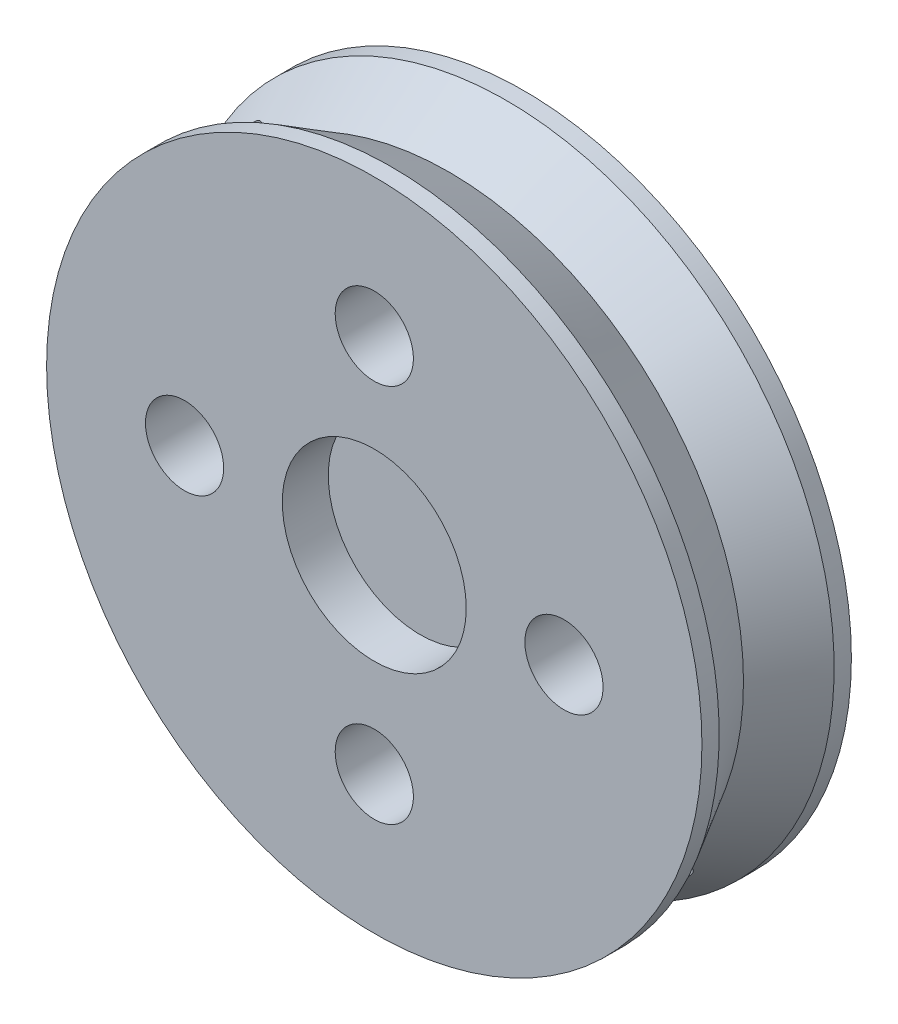
ISO-10303-21;
HEADER;
FILE_DESCRIPTION(('STEP AP214'),'2;1');
FILE_NAME('part.step','',(''),(''),'','','');
FILE_SCHEMA(('AUTOMOTIVE_DESIGN { 1 0 10303 214 1 1 1 1 }'));
ENDSEC;
DATA;
#1=APPLICATION_CONTEXT('core data for automotive mechanical design processes');
#2=APPLICATION_PROTOCOL_DEFINITION('international standard','automotive_design',2000,#1);
#3=PRODUCT_CONTEXT('',#1,'mechanical');
#4=PRODUCT('Part','Part','',(#3));
#5=PRODUCT_RELATED_PRODUCT_CATEGORY('part','',(#4));
#6=PRODUCT_DEFINITION_FORMATION('','',#4);
#7=PRODUCT_DEFINITION_CONTEXT('part definition',#1,'design');
#8=PRODUCT_DEFINITION('design','',#6,#7);
#9=PRODUCT_DEFINITION_SHAPE('','',#8);
#10=(LENGTH_UNIT() NAMED_UNIT(*) SI_UNIT(.MILLI.,.METRE.));
#11=(NAMED_UNIT(*) PLANE_ANGLE_UNIT() SI_UNIT($,.RADIAN.));
#12=(NAMED_UNIT(*) SI_UNIT($,.STERADIAN.) SOLID_ANGLE_UNIT());
#13=UNCERTAINTY_MEASURE_WITH_UNIT(LENGTH_MEASURE(1.E-05),#10,'distance_accuracy_value','');
#14=(GEOMETRIC_REPRESENTATION_CONTEXT(3) GLOBAL_UNCERTAINTY_ASSIGNED_CONTEXT((#13)) GLOBAL_UNIT_ASSIGNED_CONTEXT((#10,
#11,#12)) REPRESENTATION_CONTEXT('',''));
#15=CARTESIAN_POINT('',(0.,0.,0.));
#16=DIRECTION('',(0.,0.,1.));
#17=DIRECTION('',(1.,0.,0.));
#18=AXIS2_PLACEMENT_3D('',#15,#16,#17);
#19=CARTESIAN_POINT('',(0.,0.,3.25));
#20=DIRECTION('',(0.,0.,-1.));
#21=DIRECTION('',(-1.,0.,0.));
#22=AXIS2_PLACEMENT_3D('',#19,#20,#21);
#23=CYLINDRICAL_SURFACE('',#22,14.25);
#24=CARTESIAN_POINT('',(0.,0.,-3.25));
#25=DIRECTION('',(0.,0.,1.));
#26=DIRECTION('',(1.,0.,0.));
#27=AXIS2_PLACEMENT_3D('',#24,#25,#26);
#28=CIRCLE('',#27,14.25);
#29=CARTESIAN_POINT('',(14.25,0.,-3.25));
#30=VERTEX_POINT('',#29);
#31=EDGE_CURVE('E98',#30,#30,#28,.T.);
#32=ORIENTED_EDGE('',*,*,#31,.T.);
#33=EDGE_LOOP('',(#32));
#34=FACE_BOUND('',#33,.T.);
#35=CARTESIAN_POINT('',(0.,0.,-2.5));
#36=DIRECTION('',(0.,0.,-1.));
#37=DIRECTION('',(-1.,0.,0.));
#38=AXIS2_PLACEMENT_3D('',#35,#36,#37);
#39=CIRCLE('',#38,14.25);
#40=CARTESIAN_POINT('',(-14.25,0.,-2.5));
#41=VERTEX_POINT('',#40);
#42=EDGE_CURVE('E101',#41,#41,#39,.T.);
#43=ORIENTED_EDGE('',*,*,#42,.T.);
#44=EDGE_LOOP('',(#43));
#45=FACE_BOUND('',#44,.T.);
#46=ADVANCED_FACE('F37',(#34,#45),#23,.T.);
#47=CARTESIAN_POINT('',(0.,0.,3.25));
#48=DIRECTION('',(0.,0.,1.));
#49=DIRECTION('',(1.,0.,0.));
#50=AXIS2_PLACEMENT_3D('',#47,#48,#49);
#51=CIRCLE('',#50,14.25);
#52=CARTESIAN_POINT('',(14.25,0.,3.25));
#53=VERTEX_POINT('',#52);
#54=EDGE_CURVE('E125',#53,#53,#51,.T.);
#55=ORIENTED_EDGE('',*,*,#54,.F.);
#56=EDGE_LOOP('',(#55));
#57=FACE_BOUND('',#56,.T.);
#58=CARTESIAN_POINT('',(0.,0.,2.5));
#59=DIRECTION('',(0.,0.,-1.));
#60=DIRECTION('',(-1.,0.,0.));
#61=AXIS2_PLACEMENT_3D('',#58,#59,#60);
#62=CIRCLE('',#61,14.25);
#63=CARTESIAN_POINT('',(-14.25,0.,2.5));
#64=VERTEX_POINT('',#63);
#65=EDGE_CURVE('E75',#64,#64,#62,.T.);
#66=ORIENTED_EDGE('',*,*,#65,.F.);
#67=EDGE_LOOP('',(#66));
#68=FACE_BOUND('',#67,.T.);
#69=ADVANCED_FACE('F88',(#57,#68),#23,.T.);
#70=CARTESIAN_POINT('',(0.,0.,3.25));
#71=DIRECTION('',(0.,0.,1.));
#72=DIRECTION('',(1.,0.,0.));
#73=AXIS2_PLACEMENT_3D('',#70,#71,#72);
#74=PLANE('',#73);
#75=CARTESIAN_POINT('',(0.,0.,3.25));
#76=DIRECTION('',(0.,0.,1.));
#77=DIRECTION('',(1.,0.,0.));
#78=AXIS2_PLACEMENT_3D('',#75,#76,#77);
#79=CIRCLE('',#78,4.);
#80=CARTESIAN_POINT('',(4.,0.,3.25));
#81=VERTEX_POINT('',#80);
#82=EDGE_CURVE('E103',#81,#81,#79,.T.);
#83=ORIENTED_EDGE('',*,*,#82,.F.);
#84=EDGE_LOOP('',(#83));
#85=FACE_BOUND('',#84,.T.);
#86=CARTESIAN_POINT('',(8.25,0.,3.25));
#87=DIRECTION('',(0.,0.,-1.));
#88=DIRECTION('',(-1.,0.,0.));
#89=AXIS2_PLACEMENT_3D('',#86,#87,#88);
#90=CIRCLE('',#89,1.7);
#91=CARTESIAN_POINT('',(6.55,0.,3.25));
#92=VERTEX_POINT('',#91);
#93=EDGE_CURVE('E113',#92,#92,#90,.T.);
#94=ORIENTED_EDGE('',*,*,#93,.T.);
#95=EDGE_LOOP('',(#94));
#96=FACE_BOUND('',#95,.T.);
#97=CARTESIAN_POINT('',(0.,8.25,3.25));
#98=DIRECTION('',(0.,0.,-1.));
#99=DIRECTION('',(-1.,0.,0.));
#100=AXIS2_PLACEMENT_3D('',#97,#98,#99);
#101=CIRCLE('',#100,1.7);
#102=CARTESIAN_POINT('',(-1.7,8.25,3.25));
#103=VERTEX_POINT('',#102);
#104=EDGE_CURVE('E117',#103,#103,#101,.T.);
#105=ORIENTED_EDGE('',*,*,#104,.T.);
#106=EDGE_LOOP('',(#105));
#107=FACE_BOUND('',#106,.T.);
#108=CARTESIAN_POINT('',(-8.25,0.,3.25));
#109=DIRECTION('',(0.,0.,-1.));
#110=DIRECTION('',(-1.,0.,0.));
#111=AXIS2_PLACEMENT_3D('',#108,#109,#110);
#112=CIRCLE('',#111,1.7);
#113=CARTESIAN_POINT('',(-9.95,0.,3.25));
#114=VERTEX_POINT('',#113);
#115=EDGE_CURVE('E120',#114,#114,#112,.T.);
#116=ORIENTED_EDGE('',*,*,#115,.T.);
#117=EDGE_LOOP('',(#116));
#118=FACE_BOUND('',#117,.T.);
#119=CARTESIAN_POINT('',(0.,-8.25,3.25));
#120=DIRECTION('',(0.,0.,-1.));
#121=DIRECTION('',(-1.,0.,0.));
#122=AXIS2_PLACEMENT_3D('',#119,#120,#121);
#123=CIRCLE('',#122,1.7);
#124=CARTESIAN_POINT('',(-1.7,-8.25,3.25));
#125=VERTEX_POINT('',#124);
#126=EDGE_CURVE('E111',#125,#125,#123,.T.);
#127=ORIENTED_EDGE('',*,*,#126,.T.);
#128=EDGE_LOOP('',(#127));
#129=FACE_BOUND('',#128,.T.);
#130=ORIENTED_EDGE('',*,*,#54,.T.);
#131=EDGE_LOOP('',(#130));
#132=FACE_BOUND('',#131,.T.);
#133=ADVANCED_FACE('F93',(#85,#96,#107,#118,#129,#132),#74,.T.);
#134=CARTESIAN_POINT('',(0.,0.,-3.25));
#135=DIRECTION('',(0.,0.,1.));
#136=DIRECTION('',(1.,0.,0.));
#137=AXIS2_PLACEMENT_3D('',#134,#135,#136);
#138=PLANE('',#137);
#139=CARTESIAN_POINT('',(8.25,0.,-3.25));
#140=DIRECTION('',(0.,0.,1.));
#141=DIRECTION('',(1.,0.,0.));
#142=AXIS2_PLACEMENT_3D('',#139,#140,#141);
#143=CIRCLE('',#142,1.7);
#144=CARTESIAN_POINT('',(9.95,0.,-3.25));
#145=VERTEX_POINT('',#144);
#146=EDGE_CURVE('E130',#145,#145,#143,.T.);
#147=ORIENTED_EDGE('',*,*,#146,.T.);
#148=EDGE_LOOP('',(#147));
#149=FACE_BOUND('',#148,.T.);
#150=CARTESIAN_POINT('',(0.,8.25,-3.25));
#151=DIRECTION('',(0.,0.,1.));
#152=DIRECTION('',(1.,0.,0.));
#153=AXIS2_PLACEMENT_3D('',#150,#151,#152);
#154=CIRCLE('',#153,1.7);
#155=CARTESIAN_POINT('',(1.7,8.25,-3.25));
#156=VERTEX_POINT('',#155);
#157=EDGE_CURVE('E136',#156,#156,#154,.T.);
#158=ORIENTED_EDGE('',*,*,#157,.T.);
#159=EDGE_LOOP('',(#158));
#160=FACE_BOUND('',#159,.T.);
#161=CARTESIAN_POINT('',(-8.25,0.,-3.25));
#162=DIRECTION('',(0.,0.,1.));
#163=DIRECTION('',(1.,0.,0.));
#164=AXIS2_PLACEMENT_3D('',#161,#162,#163);
#165=CIRCLE('',#164,1.7);
#166=CARTESIAN_POINT('',(-6.55,0.,-3.25));
#167=VERTEX_POINT('',#166);
#168=EDGE_CURVE('E133',#167,#167,#165,.T.);
#169=ORIENTED_EDGE('',*,*,#168,.T.);
#170=EDGE_LOOP('',(#169));
#171=FACE_BOUND('',#170,.T.);
#172=CARTESIAN_POINT('',(0.,-8.25,-3.25));
#173=DIRECTION('',(0.,0.,1.));
#174=DIRECTION('',(1.,0.,0.));
#175=AXIS2_PLACEMENT_3D('',#172,#173,#174);
#176=CIRCLE('',#175,1.7);
#177=CARTESIAN_POINT('',(1.7,-8.25,-3.25));
#178=VERTEX_POINT('',#177);
#179=EDGE_CURVE('E116',#178,#178,#176,.T.);
#180=ORIENTED_EDGE('',*,*,#179,.T.);
#181=EDGE_LOOP('',(#180));
#182=FACE_BOUND('',#181,.T.);
#183=ORIENTED_EDGE('',*,*,#31,.F.);
#184=EDGE_LOOP('',(#183));
#185=FACE_BOUND('',#184,.T.);
#186=ADVANCED_FACE('F186',(#149,#160,#171,#182,#185),#138,.F.);
#187=CARTESIAN_POINT('',(0.,-8.25,3.25));
#188=DIRECTION('',(0.,0.,-1.));
#189=DIRECTION('',(-1.,0.,0.));
#190=AXIS2_PLACEMENT_3D('',#187,#188,#189);
#191=CYLINDRICAL_SURFACE('',#190,1.7);
#192=ORIENTED_EDGE('',*,*,#126,.F.);
#193=EDGE_LOOP('',(#192));
#194=FACE_BOUND('',#193,.T.);
#195=ORIENTED_EDGE('',*,*,#179,.F.);
#196=EDGE_LOOP('',(#195));
#197=FACE_BOUND('',#196,.T.);
#198=ADVANCED_FACE('F182',(#194,#197),#191,.F.);
#199=CARTESIAN_POINT('',(-8.25,0.,3.25));
#200=DIRECTION('',(0.,0.,-1.));
#201=DIRECTION('',(-1.,0.,0.));
#202=AXIS2_PLACEMENT_3D('',#199,#200,#201);
#203=CYLINDRICAL_SURFACE('',#202,1.7);
#204=ORIENTED_EDGE('',*,*,#115,.F.);
#205=EDGE_LOOP('',(#204));
#206=FACE_BOUND('',#205,.T.);
#207=ORIENTED_EDGE('',*,*,#168,.F.);
#208=EDGE_LOOP('',(#207));
#209=FACE_BOUND('',#208,.T.);
#210=ADVANCED_FACE('F178',(#206,#209),#203,.F.);
#211=CARTESIAN_POINT('',(0.,8.25,3.25));
#212=DIRECTION('',(0.,0.,-1.));
#213=DIRECTION('',(-1.,0.,0.));
#214=AXIS2_PLACEMENT_3D('',#211,#212,#213);
#215=CYLINDRICAL_SURFACE('',#214,1.7);
#216=ORIENTED_EDGE('',*,*,#104,.F.);
#217=EDGE_LOOP('',(#216));
#218=FACE_BOUND('',#217,.T.);
#219=ORIENTED_EDGE('',*,*,#157,.F.);
#220=EDGE_LOOP('',(#219));
#221=FACE_BOUND('',#220,.T.);
#222=ADVANCED_FACE('F174',(#218,#221),#215,.F.);
#223=CARTESIAN_POINT('',(8.25,0.,3.25));
#224=DIRECTION('',(0.,0.,-1.));
#225=DIRECTION('',(-1.,0.,0.));
#226=AXIS2_PLACEMENT_3D('',#223,#224,#225);
#227=CYLINDRICAL_SURFACE('',#226,1.7);
#228=ORIENTED_EDGE('',*,*,#93,.F.);
#229=EDGE_LOOP('',(#228));
#230=FACE_BOUND('',#229,.T.);
#231=ORIENTED_EDGE('',*,*,#146,.F.);
#232=EDGE_LOOP('',(#231));
#233=FACE_BOUND('',#232,.T.);
#234=ADVANCED_FACE('F168',(#230,#233),#227,.F.);
#235=CARTESIAN_POINT('',(0.,0.,1.25));
#236=DIRECTION('',(0.,0.,1.));
#237=DIRECTION('',(1.,0.,0.));
#238=AXIS2_PLACEMENT_3D('',#235,#236,#237);
#239=CYLINDRICAL_SURFACE('',#238,4.);
#240=CARTESIAN_POINT('',(0.,0.,1.25));
#241=DIRECTION('',(0.,0.,1.));
#242=DIRECTION('',(1.,0.,0.));
#243=AXIS2_PLACEMENT_3D('',#240,#241,#242);
#244=CIRCLE('',#243,4.);
#245=CARTESIAN_POINT('',(4.,0.,1.25));
#246=VERTEX_POINT('',#245);
#247=EDGE_CURVE('E106',#246,#246,#244,.T.);
#248=ORIENTED_EDGE('',*,*,#247,.F.);
#249=EDGE_LOOP('',(#248));
#250=FACE_BOUND('',#249,.T.);
#251=ORIENTED_EDGE('',*,*,#82,.T.);
#252=EDGE_LOOP('',(#251));
#253=FACE_BOUND('',#252,.T.);
#254=ADVANCED_FACE('F163',(#250,#253),#239,.F.);
#255=CARTESIAN_POINT('',(0.,0.,1.25));
#256=DIRECTION('',(0.,0.,1.));
#257=DIRECTION('',(1.,0.,0.));
#258=AXIS2_PLACEMENT_3D('',#255,#256,#257);
#259=PLANE('',#258);
#260=ORIENTED_EDGE('',*,*,#247,.T.);
#261=EDGE_LOOP('',(#260));
#262=FACE_BOUND('',#261,.T.);
#263=ADVANCED_FACE('F158',(#262),#259,.T.);
#264=CARTESIAN_POINT('',(0.,0.,-2.5));
#265=DIRECTION('',(0.,0.,-1.));
#266=DIRECTION('',(-1.,0.,0.));
#267=AXIS2_PLACEMENT_3D('',#264,#265,#266);
#268=CONICAL_SURFACE('',#267,14.25,0.523598775598292);
#269=ORIENTED_EDGE('',*,*,#42,.F.);
#270=EDGE_LOOP('',(#269));
#271=FACE_BOUND('',#270,.T.);
#272=CARTESIAN_POINT('',(-9.69079671991878,8.28370044744857,0.100200000000004));
#273=CARTESIAN_POINT('',(-9.72581511140447,8.30822090664354,0.02644529594719));
#274=CARTESIAN_POINT('',(-9.75564038203565,8.33920091940911,-0.047638559430386));
#275=CARTESIAN_POINT('',(-9.80399947065931,8.41274689544868,-0.194090204391514));
#276=CARTESIAN_POINT('',(-9.82249065471706,8.45535574374428,-0.266450542252277));
#277=CARTESIAN_POINT('',(-9.84551115188123,8.54483612838443,-0.397985848404719));
#278=CARTESIAN_POINT('',(-9.85146336262251,8.59056151454557,-0.457694868896665));
#279=CARTESIAN_POINT('',(-9.85288188171264,8.68857192631421,-0.57146688912725));
#280=CARTESIAN_POINT('',(-9.8483747683949,8.74084000677564,-0.625543835619254));
#281=CARTESIAN_POINT('',(-9.83028503925356,8.83829151375396,-0.714686340066969));
#282=CARTESIAN_POINT('',(-9.8189387656986,8.8824725506826,-0.751307545162907));
#283=CARTESIAN_POINT('',(-9.78901032550382,8.97297663183407,-0.818524304728153));
#284=CARTESIAN_POINT('',(-9.77042961585611,9.0192992430963,-0.84912107063304));
#285=CARTESIAN_POINT('',(-9.72570708811944,9.11311036290723,-0.903055959301775));
#286=CARTESIAN_POINT('',(-9.69951080132944,9.16060493156365,-0.926339185649925));
#287=CARTESIAN_POINT('',(-9.63990681364155,9.25463266275416,-0.963884522086547));
#288=CARTESIAN_POINT('',(-9.60650651525424,9.3011667588428,-0.978155833716208));
#289=CARTESIAN_POINT('',(-9.53831535653112,9.38525564439867,-0.995417957348251));
#290=CARTESIAN_POINT('',(-9.50429525631122,9.42318318630279,-0.999652977573657));
#291=CARTESIAN_POINT('',(-9.43260463443161,9.49547535239926,-1.00030542940599));
#292=CARTESIAN_POINT('',(-9.39493568948649,9.52984150234632,-0.996726223370881));
#293=CARTESIAN_POINT('',(-9.32001028963944,9.59166946659561,-0.982507159543687));
#294=CARTESIAN_POINT('',(-9.28291379916564,9.61944798653306,-0.972385671789535));
#295=CARTESIAN_POINT('',(-9.20776588130256,9.67046554631907,-0.946106607271757));
#296=CARTESIAN_POINT('',(-9.16971434444028,9.69370406305943,-0.929948335561806));
#297=CARTESIAN_POINT('',(-9.0917803887064,9.73639156136555,-0.891367415450536));
#298=CARTESIAN_POINT('',(-9.05189954976148,9.75559927940003,-0.868676777899872));
#299=CARTESIAN_POINT('',(-8.9731132798436,9.78869550250934,-0.818300156433108));
#300=CARTESIAN_POINT('',(-8.9342082622442,9.80258178775306,-0.790612094914946));
#301=CARTESIAN_POINT('',(-8.85313268309581,9.82665820584167,-0.727195481671077));
#302=CARTESIAN_POINT('',(-8.81120109605787,9.83612678102689,-0.690888881887666));
#303=CARTESIAN_POINT('',(-8.73034164890999,9.84879177806444,-0.614090069502888));
#304=CARTESIAN_POINT('',(-8.6914155298864,9.85198459013387,-0.573595462069736));
#305=CARTESIAN_POINT('',(-8.61135783942709,9.85251525240292,-0.482773554381558));
#306=CARTESIAN_POINT('',(-8.57083819845563,9.84885606663114,-0.431900298355095));
#307=CARTESIAN_POINT('',(-8.4954037849608,9.83420368476448,-0.327133553056357));
#308=CARTESIAN_POINT('',(-8.46049203351731,9.82320655190511,-0.273238456809138));
#309=CARTESIAN_POINT('',(-8.3984934050378,9.79506500517308,-0.166281175176765));
#310=CARTESIAN_POINT('',(-8.37110896951344,9.77824488412523,-0.113305540037967));
#311=CARTESIAN_POINT('',(-8.32259955844085,9.73878890761034,-0.00676627805356758));
#312=CARTESIAN_POINT('',(-8.30146536905265,9.71616170559783,0.0467963613422926));
#313=CARTESIAN_POINT('',(-8.28370044744841,9.69079671991892,0.100200000000003));
#314=B_SPLINE_CURVE_WITH_KNOTS('',3,(#272,#273,#274,#275,#276,#277,#278,#279,#280,#281,#282,
#283,#284,#285,#286,#287,#288,#289,#290,#291,#292,#293,#294,#295,#296,#297,#298,#299,#300,#301,
#302,#303,#304,#305,#306,#307,#308,#309,#310,#311,#312,#313),.UNSPECIFIED.,.F.,.F.,(4,2,2,2,2,2,
2,2,2,2,2,2,2,2,2,2,2,2,2,2,4),(0.,0.255397539316976,0.511749970827129,0.736969068994397,
0.96161648669053,1.13640328912081,1.3111549082454,1.4871885140142,1.6630420902561,
1.81559289276677,1.96807806762703,2.10975651977983,2.25145128679065,2.40008397319043,
2.5487785942694,2.71693313164951,2.88518436228274,3.0798291329107,3.27457841333842,
3.45987474961523,3.64489655273823),.UNSPECIFIED.);
#315=CARTESIAN_POINT('',(-9.73510840539915,8.3208948430262,0.));
#316=VERTEX_POINT('',#315);
#317=CARTESIAN_POINT('',(-8.32089484302599,9.73510840539934,0.));
#318=VERTEX_POINT('',#317);
#319=EDGE_CURVE('E11',#316,#318,#314,.T.);
#320=ORIENTED_EDGE('',*,*,#319,.T.);
#321=CARTESIAN_POINT('',(0.,0.,0.));
#322=DIRECTION('',(0.,0.,-1.));
#323=DIRECTION('',(-1.,0.,0.));
#324=AXIS2_PLACEMENT_3D('',#321,#322,#323);
#325=CIRCLE('',#324,12.806624327026);
#326=CARTESIAN_POINT('',(9.73510840539915,-8.3208948430262,0.));
#327=VERTEX_POINT('',#326);
#328=EDGE_CURVE('E57',#318,#327,#325,.T.);
#329=ORIENTED_EDGE('',*,*,#328,.T.);
#330=CARTESIAN_POINT('',(9.69079671991878,-8.28370044744856,0.100200000000004));
#331=CARTESIAN_POINT('',(9.72581511140447,-8.30822090664353,0.02644529594719));
#332=CARTESIAN_POINT('',(9.75564038203565,-8.33920091940911,-0.0476385594303857));
#333=CARTESIAN_POINT('',(9.80399947065931,-8.41274689544868,-0.194090204391513));
#334=CARTESIAN_POINT('',(9.82249065471706,-8.45535574374428,-0.266450542252276));
#335=CARTESIAN_POINT('',(9.84551115188123,-8.54483612838443,-0.397985848404718));
#336=CARTESIAN_POINT('',(9.85146336262252,-8.59056151454557,-0.457694868896666));
#337=CARTESIAN_POINT('',(9.85288188171264,-8.68857192631421,-0.571466889127251));
#338=CARTESIAN_POINT('',(9.84837476839489,-8.74084000677564,-0.625543835619256));
#339=CARTESIAN_POINT('',(9.83028503925355,-8.83829151375396,-0.714686340066971));
#340=CARTESIAN_POINT('',(9.8189387656986,-8.88247255068261,-0.751307545162908));
#341=CARTESIAN_POINT('',(9.78901032550381,-8.97297663183407,-0.818524304728153));
#342=CARTESIAN_POINT('',(9.77042961585611,-9.0192992430963,-0.849121070633041));
#343=CARTESIAN_POINT('',(9.72570708811944,-9.11311036290723,-0.903055959301776));
#344=CARTESIAN_POINT('',(9.69951080132943,-9.16060493156365,-0.926339185649926));
#345=CARTESIAN_POINT('',(9.63990681364155,-9.25463266275416,-0.963884522086547));
#346=CARTESIAN_POINT('',(9.60650651525424,-9.3011667588428,-0.978155833716208));
#347=CARTESIAN_POINT('',(9.53831535653112,-9.38525564439867,-0.995417957348251));
#348=CARTESIAN_POINT('',(9.50429525631122,-9.42318318630279,-0.999652977573657));
#349=CARTESIAN_POINT('',(9.43260463443161,-9.49547535239926,-1.00030542940599));
#350=CARTESIAN_POINT('',(9.39493568948649,-9.52984150234632,-0.996726223370881));
#351=CARTESIAN_POINT('',(9.32001028963944,-9.59166946659561,-0.982507159543688));
#352=CARTESIAN_POINT('',(9.28291379916564,-9.61944798653306,-0.972385671789536));
#353=CARTESIAN_POINT('',(9.20776588130257,-9.67046554631907,-0.946106607271759));
#354=CARTESIAN_POINT('',(9.16971434444029,-9.69370406305942,-0.929948335561808));
#355=CARTESIAN_POINT('',(9.0917803887064,-9.73639156136554,-0.891367415450538));
#356=CARTESIAN_POINT('',(9.05189954976148,-9.75559927940003,-0.868676777899875));
#357=CARTESIAN_POINT('',(8.9731132798436,-9.78869550250934,-0.818300156433111));
#358=CARTESIAN_POINT('',(8.93420826224421,-9.80258178775306,-0.790612094914949));
#359=CARTESIAN_POINT('',(8.85313268309581,-9.82665820584167,-0.727195481671082));
#360=CARTESIAN_POINT('',(8.81120109605788,-9.83612678102689,-0.690888881887671));
#361=CARTESIAN_POINT('',(8.73034164891,-9.84879177806443,-0.614090069502895));
#362=CARTESIAN_POINT('',(8.69141552988641,-9.85198459013386,-0.573595462069744));
#363=CARTESIAN_POINT('',(8.6113578394271,-9.85251525240292,-0.482773554381569));
#364=CARTESIAN_POINT('',(8.57083819845564,-9.84885606663115,-0.431900298355107));
#365=CARTESIAN_POINT('',(8.49540378496081,-9.83420368476448,-0.327133553056371));
#366=CARTESIAN_POINT('',(8.46049203351732,-9.82320655190512,-0.273238456809152));
#367=CARTESIAN_POINT('',(8.39849340503781,-9.79506500517309,-0.166281175176779));
#368=CARTESIAN_POINT('',(8.37110896951345,-9.77824488412523,-0.113305540037978));
#369=CARTESIAN_POINT('',(8.32259955844086,-9.73878890761034,-0.00676627805357348));
#370=CARTESIAN_POINT('',(8.30146536905265,-9.71616170559784,0.0467963613422896));
#371=CARTESIAN_POINT('',(8.2837004474484,-9.69079671991893,0.100200000000003));
#372=B_SPLINE_CURVE_WITH_KNOTS('',3,(#330,#331,#332,#333,#334,#335,#336,#337,#338,#339,#340,
#341,#342,#343,#344,#345,#346,#347,#348,#349,#350,#351,#352,#353,#354,#355,#356,#357,#358,#359,
#360,#361,#362,#363,#364,#365,#366,#367,#368,#369,#370,#371),.UNSPECIFIED.,.F.,.F.,(4,2,2,2,2,2,
2,2,2,2,2,2,2,2,2,2,2,2,2,2,4),(0.,0.255397539316976,0.511749970827129,0.736969068994399,
0.961616486690532,1.13640328912081,1.3111549082454,1.4871885140142,1.6630420902561,
1.81559289276677,1.96807806762703,2.10975651977982,2.25145128679065,2.40008397319042,
2.54877859426939,2.7169331316495,2.88518436228273,3.07982913291069,3.2745784133384,
3.45987474961522,3.64489655273823),.UNSPECIFIED.);
#373=CARTESIAN_POINT('',(8.32089484302599,-9.73510840539934,0.));
#374=VERTEX_POINT('',#373);
#375=EDGE_CURVE('E70',#327,#374,#372,.T.);
#376=ORIENTED_EDGE('',*,*,#375,.T.);
#377=EDGE_CURVE('E61',#374,#316,#325,.T.);
#378=ORIENTED_EDGE('',*,*,#377,.T.);
#379=EDGE_LOOP('',(#320,#329,#376,#378));
#380=FACE_BOUND('',#379,.T.);
#381=ADVANCED_FACE('F72',(#271,#380),#268,.T.);
#382=CARTESIAN_POINT('',(0.,0.,0.));
#383=DIRECTION('',(0.,0.,1.));
#384=DIRECTION('',(1.,0.,0.));
#385=AXIS2_PLACEMENT_3D('',#382,#383,#384);
#386=CONICAL_SURFACE('',#385,12.806624327026,0.523598775598293);
#387=ORIENTED_EDGE('',*,*,#65,.T.);
#388=EDGE_LOOP('',(#387));
#389=FACE_BOUND('',#388,.T.);
#390=CARTESIAN_POINT('',(-8.28370044744841,9.69079671991893,-0.100199999999996));
#391=CARTESIAN_POINT('',(-8.30822090664337,9.72581511140461,-0.0264452959471824));
#392=CARTESIAN_POINT('',(-8.33920091940895,9.75564038203579,0.0476385594303935));
#393=CARTESIAN_POINT('',(-8.41274689544852,9.80399947065945,0.194090204391521));
#394=CARTESIAN_POINT('',(-8.45535574374412,9.82249065471721,0.266450542252284));
#395=CARTESIAN_POINT('',(-8.54483612838427,9.84551115188137,0.397985848404725));
#396=CARTESIAN_POINT('',(-8.59056151454541,9.85146336262266,0.457694868896671));
#397=CARTESIAN_POINT('',(-8.68857192631404,9.85288188171278,0.571466889127256));
#398=CARTESIAN_POINT('',(-8.74084000677548,9.84837476839504,0.625543835619261));
#399=CARTESIAN_POINT('',(-8.83829151375379,9.8302850392537,0.714686340066975));
#400=CARTESIAN_POINT('',(-8.88247255068244,9.81893876569874,0.751307545162911));
#401=CARTESIAN_POINT('',(-8.9729766318339,9.78901032550396,0.818524304728155));
#402=CARTESIAN_POINT('',(-9.01929924309614,9.77042961585626,0.849121070633043));
#403=CARTESIAN_POINT('',(-9.11311036290707,9.72570708811959,0.903055959301777));
#404=CARTESIAN_POINT('',(-9.16060493156348,9.69951080132959,0.926339185649927));
#405=CARTESIAN_POINT('',(-9.254632662754,9.6399068136417,0.963884522086548));
#406=CARTESIAN_POINT('',(-9.30116675884264,9.6065065152544,0.978155833716209));
#407=CARTESIAN_POINT('',(-9.38525564439852,9.53831535653127,0.995417957348252));
#408=CARTESIAN_POINT('',(-9.42318318630263,9.50429525631138,0.999652977573657));
#409=CARTESIAN_POINT('',(-9.4954753523991,9.43260463443177,1.00030542940599));
#410=CARTESIAN_POINT('',(-9.52984150234616,9.39493568948664,0.99672622337088));
#411=CARTESIAN_POINT('',(-9.59166946659545,9.32001028963959,0.982507159543687));
#412=CARTESIAN_POINT('',(-9.6194479865329,9.28291379916579,0.972385671789534));
#413=CARTESIAN_POINT('',(-9.67046554631892,9.20776588130272,0.946106607271756));
#414=CARTESIAN_POINT('',(-9.69370406305927,9.16971434444044,0.929948335561805));
#415=CARTESIAN_POINT('',(-9.73639156136539,9.09178038870656,0.891367415450535));
#416=CARTESIAN_POINT('',(-9.75559927939988,9.05189954976164,0.868676777899871));
#417=CARTESIAN_POINT('',(-9.78869550250919,8.97311327984376,0.818300156433106));
#418=CARTESIAN_POINT('',(-9.80258178775291,8.93420826224436,0.790612094914944));
#419=CARTESIAN_POINT('',(-9.82665820584152,8.85313268309597,0.727195481671075));
#420=CARTESIAN_POINT('',(-9.83612678102674,8.81120109605803,0.690888881887662));
#421=CARTESIAN_POINT('',(-9.84879177806429,8.73034164891015,0.614090069502884));
#422=CARTESIAN_POINT('',(-9.85198459013372,8.69141552988656,0.573595462069732));
#423=CARTESIAN_POINT('',(-9.85251525240277,8.61135783942725,0.482773554381556));
#424=CARTESIAN_POINT('',(-9.848856066631,8.57083819845579,0.431900298355092));
#425=CARTESIAN_POINT('',(-9.83420368476433,8.49540378496096,0.327133553056354));
#426=CARTESIAN_POINT('',(-9.82320655190497,8.46049203351747,0.273238456809135));
#427=CARTESIAN_POINT('',(-9.79506500517294,8.39849340503796,0.166281175176764));
#428=CARTESIAN_POINT('',(-9.77824488412509,8.3711089695136,0.113305540037968));
#429=CARTESIAN_POINT('',(-9.7387889076102,8.32259955844102,0.00676627805357127));
#430=CARTESIAN_POINT('',(-9.71616170559769,8.30146536905281,-0.0467963613422873));
#431=CARTESIAN_POINT('',(-9.69079671991878,8.28370044744857,-0.100199999999997));
#432=B_SPLINE_CURVE_WITH_KNOTS('',3,(#390,#391,#392,#393,#394,#395,#396,#397,#398,#399,#400,
#401,#402,#403,#404,#405,#406,#407,#408,#409,#410,#411,#412,#413,#414,#415,#416,#417,#418,#419,
#420,#421,#422,#423,#424,#425,#426,#427,#428,#429,#430,#431),.UNSPECIFIED.,.F.,.F.,(4,2,2,2,2,2,
2,2,2,2,2,2,2,2,2,2,2,2,2,2,4),(0.,0.255397539316975,0.511749970827128,0.736969068994398,
0.961616486690529,1.1364032891208,1.3111549082454,1.4871885140142,1.66304209025609,
1.81559289276677,1.96807806762703,2.10975651977982,2.25145128679065,2.40008397319043,
2.54877859426939,2.71693313164951,2.88518436228274,3.0798291329107,3.27457841333842,
3.45987474961522,3.64489655273822),.UNSPECIFIED.);
#433=EDGE_CURVE('E50',#318,#316,#432,.T.);
#434=ORIENTED_EDGE('',*,*,#433,.T.);
#435=ORIENTED_EDGE('',*,*,#377,.F.);
#436=CARTESIAN_POINT('',(8.28370044744841,-9.69079671991892,-0.100199999999996));
#437=CARTESIAN_POINT('',(8.30822090664337,-9.7258151114046,-0.0264452959471821));
#438=CARTESIAN_POINT('',(8.33920091940895,-9.75564038203579,0.0476385594303939));
#439=CARTESIAN_POINT('',(8.41274689544852,-9.80399947065945,0.194090204391521));
#440=CARTESIAN_POINT('',(8.45535574374412,-9.82249065471721,0.266450542252284));
#441=CARTESIAN_POINT('',(8.54483612838427,-9.84551115188137,0.397985848404724));
#442=CARTESIAN_POINT('',(8.59056151454541,-9.85146336262266,0.45769486889667));
#443=CARTESIAN_POINT('',(8.68857192631404,-9.85288188171278,0.571466889127254));
#444=CARTESIAN_POINT('',(8.74084000677548,-9.84837476839504,0.625543835619259));
#445=CARTESIAN_POINT('',(8.83829151375379,-9.8302850392537,0.714686340066973));
#446=CARTESIAN_POINT('',(8.88247255068244,-9.81893876569874,0.751307545162909));
#447=CARTESIAN_POINT('',(8.9729766318339,-9.78901032550396,0.818524304728154));
#448=CARTESIAN_POINT('',(9.01929924309614,-9.77042961585626,0.849121070633043));
#449=CARTESIAN_POINT('',(9.11311036290706,-9.72570708811959,0.903055959301777));
#450=CARTESIAN_POINT('',(9.16060493156348,-9.69951080132959,0.926339185649926));
#451=CARTESIAN_POINT('',(9.254632662754,-9.6399068136417,0.963884522086546));
#452=CARTESIAN_POINT('',(9.30116675884264,-9.6065065152544,0.978155833716208));
#453=CARTESIAN_POINT('',(9.38525564439851,-9.53831535653127,0.995417957348251));
#454=CARTESIAN_POINT('',(9.42318318630263,-9.50429525631138,0.999652977573657));
#455=CARTESIAN_POINT('',(9.4954753523991,-9.43260463443177,1.00030542940599));
#456=CARTESIAN_POINT('',(9.52984150234616,-9.39493568948665,0.99672622337088));
#457=CARTESIAN_POINT('',(9.59166946659545,-9.3200102896396,0.982507159543687));
#458=CARTESIAN_POINT('',(9.6194479865329,-9.2829137991658,0.972385671789536));
#459=CARTESIAN_POINT('',(9.67046554631891,-9.20776588130273,0.946106607271758));
#460=CARTESIAN_POINT('',(9.69370406305927,-9.16971434444045,0.929948335561806));
#461=CARTESIAN_POINT('',(9.73639156136539,-9.09178038870656,0.891367415450538));
#462=CARTESIAN_POINT('',(9.75559927939988,-9.05189954976164,0.868676777899876));
#463=CARTESIAN_POINT('',(9.78869550250919,-8.97311327984376,0.818300156433113));
#464=CARTESIAN_POINT('',(9.8025817877529,-8.93420826224437,0.790612094914949));
#465=CARTESIAN_POINT('',(9.82665820584152,-8.85313268309597,0.727195481671081));
#466=CARTESIAN_POINT('',(9.83612678102674,-8.81120109605804,0.69088888188767));
#467=CARTESIAN_POINT('',(9.84879177806429,-8.73034164891016,0.614090069502894));
#468=CARTESIAN_POINT('',(9.85198459013372,-8.69141552988657,0.573595462069742));
#469=CARTESIAN_POINT('',(9.85251525240277,-8.61135783942726,0.482773554381565));
#470=CARTESIAN_POINT('',(9.848856066631,-8.5708381984558,0.431900298355102));
#471=CARTESIAN_POINT('',(9.83420368476434,-8.49540378496097,0.327133553056364));
#472=CARTESIAN_POINT('',(9.82320655190497,-8.46049203351747,0.273238456809145));
#473=CARTESIAN_POINT('',(9.79506500517295,-8.39849340503797,0.166281175176773));
#474=CARTESIAN_POINT('',(9.77824488412509,-8.3711089695136,0.113305540037975));
#475=CARTESIAN_POINT('',(9.7387889076102,-8.32259955844102,0.00676627805357446));
#476=CARTESIAN_POINT('',(9.7161617055977,-8.30146536905281,-0.0467963613422864));
#477=CARTESIAN_POINT('',(9.69079671991878,-8.28370044744857,-0.100199999999997));
#478=B_SPLINE_CURVE_WITH_KNOTS('',3,(#436,#437,#438,#439,#440,#441,#442,#443,#444,#445,#446,
#447,#448,#449,#450,#451,#452,#453,#454,#455,#456,#457,#458,#459,#460,#461,#462,#463,#464,#465,
#466,#467,#468,#469,#470,#471,#472,#473,#474,#475,#476,#477),.UNSPECIFIED.,.F.,.F.,(4,2,2,2,2,2,
2,2,2,2,2,2,2,2,2,2,2,2,2,2,4),(0.,0.255397539316976,0.511749970827128,0.736969068994395,
0.961616486690527,1.1364032891208,1.31115490824539,1.48718851401419,1.66304209025609,
1.81559289276676,1.96807806762702,2.10975651977982,2.25145128679064,2.40008397319042,
2.54877859426938,2.71693313164949,2.88518436228273,3.07982913291069,3.2745784133384,
3.45987474961521,3.64489655273822),.UNSPECIFIED.);
#479=EDGE_CURVE('E128',#374,#327,#478,.T.);
#480=ORIENTED_EDGE('',*,*,#479,.T.);
#481=ORIENTED_EDGE('',*,*,#328,.F.);
#482=EDGE_LOOP('',(#434,#435,#480,#481));
#483=FACE_BOUND('',#482,.T.);
#484=ADVANCED_FACE('F67',(#389,#483),#386,.T.);
#485=CARTESIAN_POINT('',(-14.2499999999999,14.2500000000001,0.));
#486=DIRECTION('',(0.707106781186542,-0.707106781186554,0.));
#487=DIRECTION('',(0.707106781186554,0.707106781186542,0.));
#488=AXIS2_PLACEMENT_3D('',#485,#486,#487);
#489=CYLINDRICAL_SURFACE('',#488,1.);
#490=ORIENTED_EDGE('',*,*,#375,.F.);
#491=ORIENTED_EDGE('',*,*,#479,.F.);
#492=EDGE_LOOP('',(#490,#491));
#493=FACE_BOUND('',#492,.T.);
#494=ORIENTED_EDGE('',*,*,#319,.F.);
#495=ORIENTED_EDGE('',*,*,#433,.F.);
#496=EDGE_LOOP('',(#494,#495));
#497=FACE_BOUND('',#496,.T.);
#498=ADVANCED_FACE('F77',(#493,#497),#489,.F.);
#499=CLOSED_SHELL('',(#46,#69,#133,#186,#198,#210,#222,#234,#254,#263,#381,#484,#498));
#500=MANIFOLD_SOLID_BREP('B2',#499);
#501=ADVANCED_BREP_SHAPE_REPRESENTATION('',(#18,#500),#14);
#502=SHAPE_DEFINITION_REPRESENTATION(#9,#501);
ENDSEC;
END-ISO-10303-21;
